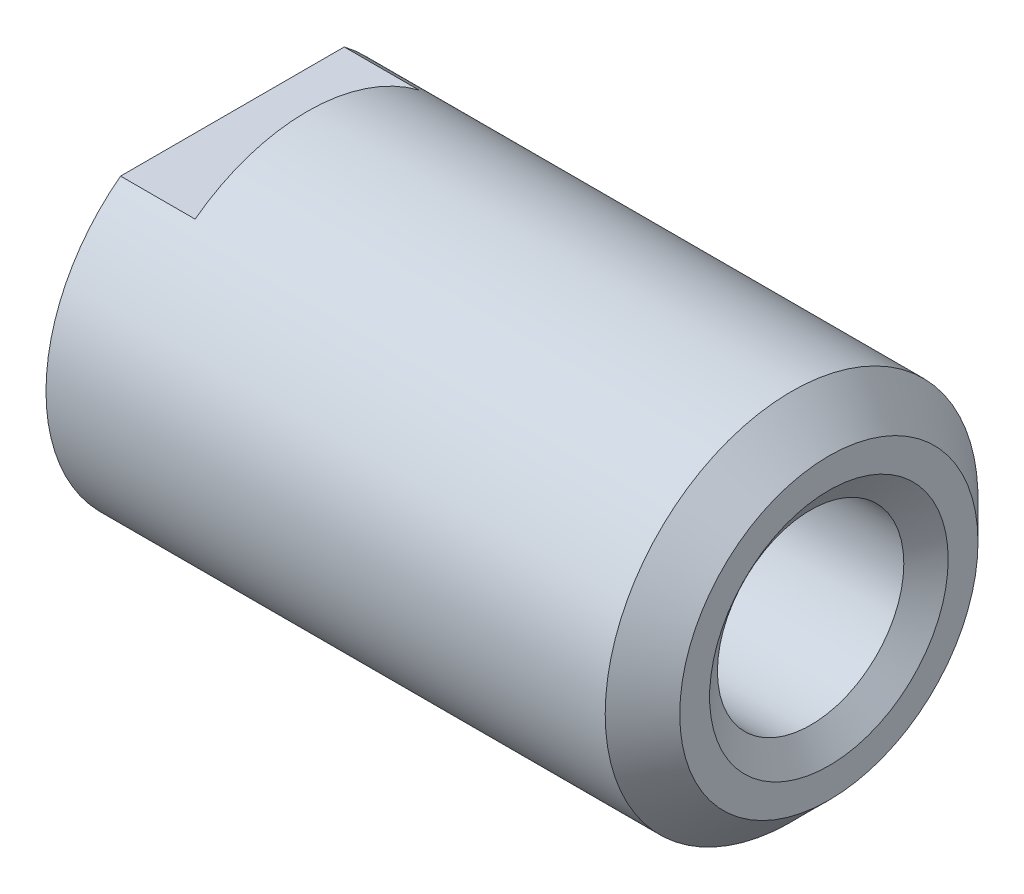
ISO-10303-21;
HEADER;
FILE_DESCRIPTION(('STEP AP214'),'2;1');
FILE_NAME('part.step','',(''),(''),'','','');
FILE_SCHEMA(('AUTOMOTIVE_DESIGN { 1 0 10303 214 1 1 1 1 }'));
ENDSEC;
DATA;
#1=APPLICATION_CONTEXT('core data for automotive mechanical design processes');
#2=APPLICATION_PROTOCOL_DEFINITION('international standard','automotive_design',2000,#1);
#3=PRODUCT_CONTEXT('',#1,'mechanical');
#4=PRODUCT('Part','Part','',(#3));
#5=PRODUCT_RELATED_PRODUCT_CATEGORY('part','',(#4));
#6=PRODUCT_DEFINITION_FORMATION('','',#4);
#7=PRODUCT_DEFINITION_CONTEXT('part definition',#1,'design');
#8=PRODUCT_DEFINITION('design','',#6,#7);
#9=PRODUCT_DEFINITION_SHAPE('','',#8);
#10=(LENGTH_UNIT() NAMED_UNIT(*) SI_UNIT(.MILLI.,.METRE.));
#11=(NAMED_UNIT(*) PLANE_ANGLE_UNIT() SI_UNIT($,.RADIAN.));
#12=(NAMED_UNIT(*) SI_UNIT($,.STERADIAN.) SOLID_ANGLE_UNIT());
#13=UNCERTAINTY_MEASURE_WITH_UNIT(LENGTH_MEASURE(1.E-05),#10,'distance_accuracy_value','');
#14=(GEOMETRIC_REPRESENTATION_CONTEXT(3) GLOBAL_UNCERTAINTY_ASSIGNED_CONTEXT((#13)) GLOBAL_UNIT_ASSIGNED_CONTEXT((#10,
#11,#12)) REPRESENTATION_CONTEXT('',''));
#15=CARTESIAN_POINT('',(0.,0.,0.));
#16=DIRECTION('',(0.,0.,1.));
#17=DIRECTION('',(1.,0.,0.));
#18=AXIS2_PLACEMENT_3D('',#15,#16,#17);
#19=CARTESIAN_POINT('',(0.,1.25,0.));
#20=DIRECTION('',(1.,0.,0.));
#21=DIRECTION('',(0.,0.,-1.));
#22=AXIS2_PLACEMENT_3D('',#19,#20,#21);
#23=PLANE('',#22);
#24=CARTESIAN_POINT('',(0.,0.,0.));
#25=DIRECTION('',(1.,0.,0.));
#26=DIRECTION('',(0.,0.,-1.));
#27=AXIS2_PLACEMENT_3D('',#24,#25,#26);
#28=CIRCLE('',#27,1.6);
#29=CARTESIAN_POINT('',(0.,0.,-1.6));
#30=VERTEX_POINT('',#29);
#31=EDGE_CURVE('E102',#30,#30,#28,.T.);
#32=ORIENTED_EDGE('',*,*,#31,.T.);
#33=EDGE_LOOP('',(#32));
#34=FACE_BOUND('',#33,.T.);
#35=CARTESIAN_POINT('',(0.,0.,0.));
#36=DIRECTION('',(-1.,0.,0.));
#37=DIRECTION('',(0.,0.,1.));
#38=AXIS2_PLACEMENT_3D('',#35,#36,#37);
#39=CIRCLE('',#38,2.5);
#40=CARTESIAN_POINT('',(0.,2.,-1.5));
#41=VERTEX_POINT('',#40);
#42=CARTESIAN_POINT('',(0.,-2.,-1.5));
#43=VERTEX_POINT('',#42);
#44=EDGE_CURVE('E115',#41,#43,#39,.T.);
#45=ORIENTED_EDGE('',*,*,#44,.T.);
#46=DIRECTION('',(0.,0.,-1.));
#47=VECTOR('',#46,1.);
#48=CARTESIAN_POINT('',(0.,-2.,0.));
#49=LINE('',#48,#47);
#50=CARTESIAN_POINT('',(0.,-2.,1.5));
#51=VERTEX_POINT('',#50);
#52=EDGE_CURVE('E77',#51,#43,#49,.T.);
#53=ORIENTED_EDGE('',*,*,#52,.F.);
#54=CARTESIAN_POINT('',(0.,2.,1.5));
#55=VERTEX_POINT('',#54);
#56=EDGE_CURVE('E88',#51,#55,#39,.T.);
#57=ORIENTED_EDGE('',*,*,#56,.T.);
#58=DIRECTION('',(0.,0.,1.));
#59=VECTOR('',#58,1.);
#60=CARTESIAN_POINT('',(0.,2.,0.));
#61=LINE('',#60,#59);
#62=EDGE_CURVE('E90',#41,#55,#61,.T.);
#63=ORIENTED_EDGE('',*,*,#62,.F.);
#64=EDGE_LOOP('',(#45,#53,#57,#63));
#65=FACE_BOUND('',#64,.T.);
#66=ADVANCED_FACE('F33',(#34,#65),#23,.F.);
#67=CARTESIAN_POINT('',(0.,0.,0.));
#68=DIRECTION('',(-1.,0.,0.));
#69=DIRECTION('',(0.,0.,1.));
#70=AXIS2_PLACEMENT_3D('',#67,#68,#69);
#71=CYLINDRICAL_SURFACE('',#70,2.5);
#72=CARTESIAN_POINT('',(7.5,0.,0.));
#73=DIRECTION('',(-1.,0.,0.));
#74=DIRECTION('',(0.,0.,1.));
#75=AXIS2_PLACEMENT_3D('',#72,#73,#74);
#76=CIRCLE('',#75,2.5);
#77=CARTESIAN_POINT('',(7.5,0.,2.5));
#78=VERTEX_POINT('',#77);
#79=EDGE_CURVE('E41',#78,#78,#76,.T.);
#80=ORIENTED_EDGE('',*,*,#79,.T.);
#81=EDGE_LOOP('',(#80));
#82=FACE_BOUND('',#81,.T.);
#83=CARTESIAN_POINT('',(1.,0.,0.));
#84=DIRECTION('',(-1.,0.,0.));
#85=DIRECTION('',(0.,0.,1.));
#86=AXIS2_PLACEMENT_3D('',#83,#84,#85);
#87=CIRCLE('',#86,2.5);
#88=CARTESIAN_POINT('',(1.,-2.,-1.5));
#89=VERTEX_POINT('',#88);
#90=CARTESIAN_POINT('',(1.,-2.,1.5));
#91=VERTEX_POINT('',#90);
#92=EDGE_CURVE('E72',#89,#91,#87,.T.);
#93=ORIENTED_EDGE('',*,*,#92,.F.);
#94=DIRECTION('',(-1.,0.,0.));
#95=VECTOR('',#94,1.);
#96=CARTESIAN_POINT('',(1.,-2.,-1.5));
#97=LINE('',#96,#95);
#98=EDGE_CURVE('E83',#89,#43,#97,.T.);
#99=ORIENTED_EDGE('',*,*,#98,.T.);
#100=ORIENTED_EDGE('',*,*,#44,.F.);
#101=DIRECTION('',(-1.,0.,0.));
#102=VECTOR('',#101,1.);
#103=CARTESIAN_POINT('',(1.,2.,-1.5));
#104=LINE('',#103,#102);
#105=CARTESIAN_POINT('',(1.,2.,-1.5));
#106=VERTEX_POINT('',#105);
#107=EDGE_CURVE('E97',#106,#41,#104,.T.);
#108=ORIENTED_EDGE('',*,*,#107,.F.);
#109=CARTESIAN_POINT('',(1.,0.,0.));
#110=DIRECTION('',(-1.,0.,0.));
#111=DIRECTION('',(0.,0.,1.));
#112=AXIS2_PLACEMENT_3D('',#109,#110,#111);
#113=CIRCLE('',#112,2.5);
#114=CARTESIAN_POINT('',(1.,2.,1.5));
#115=VERTEX_POINT('',#114);
#116=EDGE_CURVE('E94',#115,#106,#113,.T.);
#117=ORIENTED_EDGE('',*,*,#116,.F.);
#118=DIRECTION('',(-1.,0.,0.));
#119=VECTOR('',#118,1.);
#120=CARTESIAN_POINT('',(1.,2.,1.5));
#121=LINE('',#120,#119);
#122=EDGE_CURVE('E100',#115,#55,#121,.T.);
#123=ORIENTED_EDGE('',*,*,#122,.T.);
#124=ORIENTED_EDGE('',*,*,#56,.F.);
#125=DIRECTION('',(-1.,0.,0.));
#126=VECTOR('',#125,1.);
#127=CARTESIAN_POINT('',(1.,-2.,1.5));
#128=LINE('',#127,#126);
#129=EDGE_CURVE('E81',#91,#51,#128,.T.);
#130=ORIENTED_EDGE('',*,*,#129,.F.);
#131=EDGE_LOOP('',(#93,#99,#100,#108,#117,#123,#124,#130));
#132=FACE_BOUND('',#131,.T.);
#133=ADVANCED_FACE('F86',(#82,#132),#71,.T.);
#134=CARTESIAN_POINT('',(8.,2.5,0.));
#135=DIRECTION('',(-1.,0.,0.));
#136=DIRECTION('',(0.,0.,1.));
#137=AXIS2_PLACEMENT_3D('',#134,#135,#136);
#138=PLANE('',#137);
#139=CARTESIAN_POINT('',(8.,0.,0.));
#140=DIRECTION('',(-1.,0.,0.));
#141=DIRECTION('',(0.,0.,1.));
#142=AXIS2_PLACEMENT_3D('',#139,#140,#141);
#143=CIRCLE('',#142,2.);
#144=CARTESIAN_POINT('',(8.,0.,2.));
#145=VERTEX_POINT('',#144);
#146=EDGE_CURVE('E11',#145,#145,#143,.F.);
#147=ORIENTED_EDGE('',*,*,#146,.T.);
#148=EDGE_LOOP('',(#147));
#149=FACE_BOUND('',#148,.T.);
#150=CARTESIAN_POINT('',(8.,0.,0.));
#151=DIRECTION('',(1.,0.,0.));
#152=DIRECTION('',(0.,0.,-1.));
#153=AXIS2_PLACEMENT_3D('',#150,#151,#152);
#154=CIRCLE('',#153,1.6);
#155=CARTESIAN_POINT('',(8.,0.,-1.6));
#156=VERTEX_POINT('',#155);
#157=EDGE_CURVE('E106',#156,#156,#154,.T.);
#158=ORIENTED_EDGE('',*,*,#157,.F.);
#159=EDGE_LOOP('',(#158));
#160=FACE_BOUND('',#159,.T.);
#161=ADVANCED_FACE('F141',(#149,#160),#138,.F.);
#162=CARTESIAN_POINT('',(8.,0.,0.));
#163=DIRECTION('',(1.,0.,0.));
#164=DIRECTION('',(0.,0.,-1.));
#165=AXIS2_PLACEMENT_3D('',#162,#163,#164);
#166=CONICAL_SURFACE('',#165,1.6,0.959931088596879);
#167=CARTESIAN_POINT('',(7.7549273616266,0.,0.));
#168=DIRECTION('',(1.,0.,0.));
#169=DIRECTION('',(0.,0.,-1.));
#170=AXIS2_PLACEMENT_3D('',#167,#168,#169);
#171=CIRCLE('',#170,1.25);
#172=CARTESIAN_POINT('',(7.7549273616266,0.,-1.25));
#173=VERTEX_POINT('',#172);
#174=EDGE_CURVE('E109',#173,#173,#171,.T.);
#175=ORIENTED_EDGE('',*,*,#174,.F.);
#176=EDGE_LOOP('',(#175));
#177=FACE_BOUND('',#176,.T.);
#178=ORIENTED_EDGE('',*,*,#157,.T.);
#179=EDGE_LOOP('',(#178));
#180=FACE_BOUND('',#179,.T.);
#181=ADVANCED_FACE('F147',(#177,#180),#166,.F.);
#182=CARTESIAN_POINT('',(0.2450726383734,0.,0.));
#183=DIRECTION('',(-1.,0.,0.));
#184=DIRECTION('',(0.,0.,1.));
#185=AXIS2_PLACEMENT_3D('',#182,#183,#184);
#186=CONICAL_SURFACE('',#185,1.25,0.959931088596878);
#187=ORIENTED_EDGE('',*,*,#31,.F.);
#188=EDGE_LOOP('',(#187));
#189=FACE_BOUND('',#188,.T.);
#190=CARTESIAN_POINT('',(0.2450726383734,0.,0.));
#191=DIRECTION('',(1.,0.,0.));
#192=DIRECTION('',(0.,0.,-1.));
#193=AXIS2_PLACEMENT_3D('',#190,#191,#192);
#194=CIRCLE('',#193,1.25);
#195=CARTESIAN_POINT('',(0.2450726383734,0.,-1.25));
#196=VERTEX_POINT('',#195);
#197=EDGE_CURVE('E112',#196,#196,#194,.T.);
#198=ORIENTED_EDGE('',*,*,#197,.T.);
#199=EDGE_LOOP('',(#198));
#200=FACE_BOUND('',#199,.T.);
#201=ADVANCED_FACE('F132',(#189,#200),#186,.F.);
#202=CARTESIAN_POINT('',(0.,0.,0.));
#203=DIRECTION('',(-1.,0.,0.));
#204=DIRECTION('',(0.,0.,1.));
#205=AXIS2_PLACEMENT_3D('',#202,#203,#204);
#206=CYLINDRICAL_SURFACE('',#205,1.25);
#207=ORIENTED_EDGE('',*,*,#174,.T.);
#208=EDGE_LOOP('',(#207));
#209=FACE_BOUND('',#208,.T.);
#210=ORIENTED_EDGE('',*,*,#197,.F.);
#211=EDGE_LOOP('',(#210));
#212=FACE_BOUND('',#211,.T.);
#213=ADVANCED_FACE('F123',(#209,#212),#206,.F.);
#214=CARTESIAN_POINT('',(7.5,0.,0.));
#215=DIRECTION('',(-1.,0.,0.));
#216=DIRECTION('',(0.,0.,1.));
#217=AXIS2_PLACEMENT_3D('',#214,#215,#216);
#218=CONICAL_SURFACE('',#217,2.5,0.78539816339745);
#219=ORIENTED_EDGE('',*,*,#146,.F.);
#220=EDGE_LOOP('',(#219));
#221=FACE_BOUND('',#220,.T.);
#222=ORIENTED_EDGE('',*,*,#79,.F.);
#223=EDGE_LOOP('',(#222));
#224=FACE_BOUND('',#223,.T.);
#225=ADVANCED_FACE('F35',(#221,#224),#218,.T.);
#226=CARTESIAN_POINT('',(1.,2.,0.));
#227=DIRECTION('',(0.,-1.,0.));
#228=DIRECTION('',(0.,0.,-1.));
#229=AXIS2_PLACEMENT_3D('',#226,#227,#228);
#230=PLANE('',#229);
#231=ORIENTED_EDGE('',*,*,#62,.T.);
#232=ORIENTED_EDGE('',*,*,#122,.F.);
#233=DIRECTION('',(0.,0.,1.));
#234=VECTOR('',#233,1.);
#235=CARTESIAN_POINT('',(1.,2.,0.));
#236=LINE('',#235,#234);
#237=EDGE_CURVE('E54',#106,#115,#236,.T.);
#238=ORIENTED_EDGE('',*,*,#237,.F.);
#239=ORIENTED_EDGE('',*,*,#107,.T.);
#240=EDGE_LOOP('',(#231,#232,#238,#239));
#241=FACE_BOUND('',#240,.T.);
#242=ADVANCED_FACE('F122',(#241),#230,.F.);
#243=CARTESIAN_POINT('',(1.,-5.64142135623731,0.));
#244=DIRECTION('',(-1.,0.,0.));
#245=DIRECTION('',(0.,0.,1.));
#246=AXIS2_PLACEMENT_3D('',#243,#244,#245);
#247=PLANE('',#246);
#248=ORIENTED_EDGE('',*,*,#116,.T.);
#249=ORIENTED_EDGE('',*,*,#237,.T.);
#250=EDGE_LOOP('',(#248,#249));
#251=FACE_BOUND('',#250,.T.);
#252=ADVANCED_FACE('F129',(#251),#247,.T.);
#253=CARTESIAN_POINT('',(1.,-2.,0.));
#254=DIRECTION('',(0.,1.,0.));
#255=DIRECTION('',(0.,0.,1.));
#256=AXIS2_PLACEMENT_3D('',#253,#254,#255);
#257=PLANE('',#256);
#258=ORIENTED_EDGE('',*,*,#52,.T.);
#259=ORIENTED_EDGE('',*,*,#98,.F.);
#260=DIRECTION('',(0.,0.,-1.));
#261=VECTOR('',#260,1.);
#262=CARTESIAN_POINT('',(1.,-2.,0.));
#263=LINE('',#262,#261);
#264=EDGE_CURVE('E47',#91,#89,#263,.T.);
#265=ORIENTED_EDGE('',*,*,#264,.F.);
#266=ORIENTED_EDGE('',*,*,#129,.T.);
#267=EDGE_LOOP('',(#258,#259,#265,#266));
#268=FACE_BOUND('',#267,.T.);
#269=ADVANCED_FACE('F80',(#268),#257,.F.);
#270=CARTESIAN_POINT('',(1.,-5.64142135623731,0.));
#271=DIRECTION('',(-1.,0.,0.));
#272=DIRECTION('',(0.,0.,1.));
#273=AXIS2_PLACEMENT_3D('',#270,#271,#272);
#274=PLANE('',#273);
#275=ORIENTED_EDGE('',*,*,#92,.T.);
#276=ORIENTED_EDGE('',*,*,#264,.T.);
#277=EDGE_LOOP('',(#275,#276));
#278=FACE_BOUND('',#277,.T.);
#279=ADVANCED_FACE('F73',(#278),#274,.T.);
#280=CLOSED_SHELL('',(#66,#133,#161,#181,#201,#213,#225,#242,#252,#269,#279));
#281=MANIFOLD_SOLID_BREP('B2',#280);
#282=ADVANCED_BREP_SHAPE_REPRESENTATION('',(#18,#281),#14);
#283=SHAPE_DEFINITION_REPRESENTATION(#9,#282);
ENDSEC;
END-ISO-10303-21;
